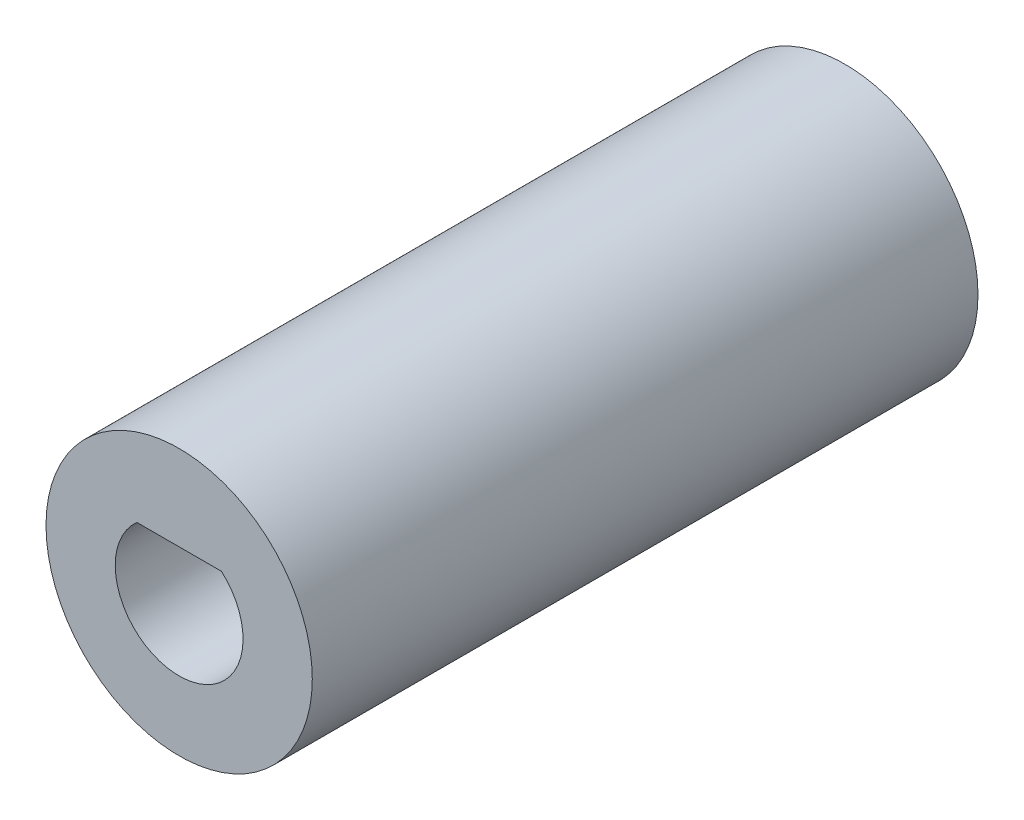
ISO-10303-21;
HEADER;
FILE_DESCRIPTION(('STEP AP214'),'2;1');
FILE_NAME('part.step','',(''),(''),'','','');
FILE_SCHEMA(('AUTOMOTIVE_DESIGN { 1 0 10303 214 1 1 1 1 }'));
ENDSEC;
DATA;
#1=APPLICATION_CONTEXT('core data for automotive mechanical design processes');
#2=APPLICATION_PROTOCOL_DEFINITION('international standard','automotive_design',2000,#1);
#3=PRODUCT_CONTEXT('',#1,'mechanical');
#4=PRODUCT('Part','Part','',(#3));
#5=PRODUCT_RELATED_PRODUCT_CATEGORY('part','',(#4));
#6=PRODUCT_DEFINITION_FORMATION('','',#4);
#7=PRODUCT_DEFINITION_CONTEXT('part definition',#1,'design');
#8=PRODUCT_DEFINITION('design','',#6,#7);
#9=PRODUCT_DEFINITION_SHAPE('','',#8);
#10=(LENGTH_UNIT() NAMED_UNIT(*) SI_UNIT(.MILLI.,.METRE.));
#11=(NAMED_UNIT(*) PLANE_ANGLE_UNIT() SI_UNIT($,.RADIAN.));
#12=(NAMED_UNIT(*) SI_UNIT($,.STERADIAN.) SOLID_ANGLE_UNIT());
#13=UNCERTAINTY_MEASURE_WITH_UNIT(LENGTH_MEASURE(1.E-05),#10,'distance_accuracy_value','');
#14=(GEOMETRIC_REPRESENTATION_CONTEXT(3) GLOBAL_UNCERTAINTY_ASSIGNED_CONTEXT((#13)) GLOBAL_UNIT_ASSIGNED_CONTEXT((#10,
#11,#12)) REPRESENTATION_CONTEXT('',''));
#15=CARTESIAN_POINT('',(0.,0.,0.));
#16=DIRECTION('',(0.,0.,1.));
#17=DIRECTION('',(1.,0.,0.));
#18=AXIS2_PLACEMENT_3D('',#15,#16,#17);
#19=CARTESIAN_POINT('',(0.,0.,31.75));
#20=DIRECTION('',(0.,0.,-1.));
#21=DIRECTION('',(-1.,0.,0.));
#22=AXIS2_PLACEMENT_3D('',#19,#20,#21);
#23=CYLINDRICAL_SURFACE('',#22,6.35);
#24=CARTESIAN_POINT('',(0.,0.,31.75));
#25=DIRECTION('',(0.,0.,1.));
#26=DIRECTION('',(1.,0.,0.));
#27=AXIS2_PLACEMENT_3D('',#24,#25,#26);
#28=CIRCLE('',#27,6.35);
#29=CARTESIAN_POINT('',(6.35,0.,31.75));
#30=VERTEX_POINT('',#29);
#31=EDGE_CURVE('E11',#30,#30,#28,.T.);
#32=ORIENTED_EDGE('',*,*,#31,.F.);
#33=EDGE_LOOP('',(#32));
#34=FACE_BOUND('',#33,.T.);
#35=CARTESIAN_POINT('',(0.,0.,0.));
#36=DIRECTION('',(0.,0.,1.));
#37=DIRECTION('',(1.,0.,0.));
#38=AXIS2_PLACEMENT_3D('',#35,#36,#37);
#39=CIRCLE('',#38,6.35);
#40=CARTESIAN_POINT('',(6.35,0.,0.));
#41=VERTEX_POINT('',#40);
#42=EDGE_CURVE('E38',#41,#41,#39,.T.);
#43=ORIENTED_EDGE('',*,*,#42,.T.);
#44=EDGE_LOOP('',(#43));
#45=FACE_BOUND('',#44,.T.);
#46=ADVANCED_FACE('F35',(#34,#45),#23,.T.);
#47=CARTESIAN_POINT('',(0.,0.,31.75));
#48=DIRECTION('',(0.,0.,1.));
#49=DIRECTION('',(1.,0.,0.));
#50=AXIS2_PLACEMENT_3D('',#47,#48,#49);
#51=PLANE('',#50);
#52=CARTESIAN_POINT('',(0.,0.,31.75));
#53=DIRECTION('',(0.,0.,1.));
#54=DIRECTION('',(1.,0.,0.));
#55=AXIS2_PLACEMENT_3D('',#52,#53,#54);
#56=CIRCLE('',#55,3.048);
#57=CARTESIAN_POINT('',(-2.01606249903122,2.286,31.75));
#58=VERTEX_POINT('',#57);
#59=CARTESIAN_POINT('',(2.01606249903122,2.286,31.75));
#60=VERTEX_POINT('',#59);
#61=EDGE_CURVE('E49',#58,#60,#56,.T.);
#62=ORIENTED_EDGE('',*,*,#61,.F.);
#63=DIRECTION('',(-1.,0.,0.));
#64=VECTOR('',#63,1.);
#65=CARTESIAN_POINT('',(2.01606249903122,2.286,31.75));
#66=LINE('',#65,#64);
#67=EDGE_CURVE('E71',#60,#58,#66,.T.);
#68=ORIENTED_EDGE('',*,*,#67,.F.);
#69=EDGE_LOOP('',(#62,#68));
#70=FACE_BOUND('',#69,.T.);
#71=ORIENTED_EDGE('',*,*,#31,.T.);
#72=EDGE_LOOP('',(#71));
#73=FACE_BOUND('',#72,.T.);
#74=ADVANCED_FACE('F83',(#70,#73),#51,.T.);
#75=CARTESIAN_POINT('',(0.,0.,0.));
#76=DIRECTION('',(0.,0.,1.));
#77=DIRECTION('',(1.,0.,0.));
#78=AXIS2_PLACEMENT_3D('',#75,#76,#77);
#79=PLANE('',#78);
#80=CARTESIAN_POINT('',(0.,0.,0.));
#81=DIRECTION('',(0.,0.,-1.));
#82=DIRECTION('',(-1.,0.,0.));
#83=AXIS2_PLACEMENT_3D('',#80,#81,#82);
#84=CIRCLE('',#83,3.175);
#85=CARTESIAN_POINT('',(-3.175,0.,0.));
#86=VERTEX_POINT('',#85);
#87=EDGE_CURVE('E77',#86,#86,#84,.T.);
#88=ORIENTED_EDGE('',*,*,#87,.F.);
#89=EDGE_LOOP('',(#88));
#90=FACE_BOUND('',#89,.T.);
#91=ORIENTED_EDGE('',*,*,#42,.F.);
#92=EDGE_LOOP('',(#91));
#93=FACE_BOUND('',#92,.T.);
#94=ADVANCED_FACE('F86',(#90,#93),#79,.F.);
#95=CARTESIAN_POINT('',(0.,0.,12.7));
#96=DIRECTION('',(0.,0.,1.));
#97=DIRECTION('',(1.,0.,0.));
#98=AXIS2_PLACEMENT_3D('',#95,#96,#97);
#99=CYLINDRICAL_SURFACE('',#98,3.048);
#100=ORIENTED_EDGE('',*,*,#61,.T.);
#101=DIRECTION('',(0.,0.,1.));
#102=VECTOR('',#101,1.);
#103=CARTESIAN_POINT('',(2.01606249903122,2.286,12.7));
#104=LINE('',#103,#102);
#105=CARTESIAN_POINT('',(2.01606249903122,2.286,12.7));
#106=VERTEX_POINT('',#105);
#107=EDGE_CURVE('E65',#106,#60,#104,.T.);
#108=ORIENTED_EDGE('',*,*,#107,.F.);
#109=CARTESIAN_POINT('',(0.,0.,12.7));
#110=DIRECTION('',(0.,0.,1.));
#111=DIRECTION('',(1.,0.,0.));
#112=AXIS2_PLACEMENT_3D('',#109,#110,#111);
#113=CIRCLE('',#112,3.048);
#114=CARTESIAN_POINT('',(-2.01606249903122,2.286,12.7));
#115=VERTEX_POINT('',#114);
#116=EDGE_CURVE('E57',#115,#106,#113,.T.);
#117=ORIENTED_EDGE('',*,*,#116,.F.);
#118=DIRECTION('',(0.,0.,1.));
#119=VECTOR('',#118,1.);
#120=CARTESIAN_POINT('',(-2.01606249903122,2.286,12.7));
#121=LINE('',#120,#119);
#122=EDGE_CURVE('E68',#115,#58,#121,.T.);
#123=ORIENTED_EDGE('',*,*,#122,.T.);
#124=EDGE_LOOP('',(#100,#108,#117,#123));
#125=FACE_BOUND('',#124,.T.);
#126=ADVANCED_FACE('F73',(#125),#99,.F.);
#127=CARTESIAN_POINT('',(2.01606249903122,2.286,12.7));
#128=DIRECTION('',(0.,1.,0.));
#129=DIRECTION('',(0.,0.,1.));
#130=AXIS2_PLACEMENT_3D('',#127,#128,#129);
#131=PLANE('',#130);
#132=ORIENTED_EDGE('',*,*,#67,.T.);
#133=ORIENTED_EDGE('',*,*,#122,.F.);
#134=DIRECTION('',(-1.,0.,0.));
#135=VECTOR('',#134,1.);
#136=CARTESIAN_POINT('',(2.01606249903122,2.286,12.7));
#137=LINE('',#136,#135);
#138=EDGE_CURVE('E61',#106,#115,#137,.T.);
#139=ORIENTED_EDGE('',*,*,#138,.F.);
#140=ORIENTED_EDGE('',*,*,#107,.T.);
#141=EDGE_LOOP('',(#132,#133,#139,#140));
#142=FACE_BOUND('',#141,.T.);
#143=ADVANCED_FACE('F69',(#142),#131,.F.);
#144=CARTESIAN_POINT('',(0.,0.,12.7));
#145=DIRECTION('',(0.,0.,-1.));
#146=DIRECTION('',(-1.,0.,0.));
#147=AXIS2_PLACEMENT_3D('',#144,#145,#146);
#148=PLANE('',#147);
#149=CARTESIAN_POINT('',(0.,0.,12.7));
#150=DIRECTION('',(0.,0.,-1.));
#151=DIRECTION('',(-1.,0.,0.));
#152=AXIS2_PLACEMENT_3D('',#149,#150,#151);
#153=CIRCLE('',#152,3.175);
#154=CARTESIAN_POINT('',(-3.175,0.,12.7));
#155=VERTEX_POINT('',#154);
#156=EDGE_CURVE('E80',#155,#155,#153,.T.);
#157=ORIENTED_EDGE('',*,*,#156,.T.);
#158=EDGE_LOOP('',(#157));
#159=FACE_BOUND('',#158,.T.);
#160=ORIENTED_EDGE('',*,*,#116,.T.);
#161=ORIENTED_EDGE('',*,*,#138,.T.);
#162=EDGE_LOOP('',(#160,#161));
#163=FACE_BOUND('',#162,.T.);
#164=ADVANCED_FACE('F63',(#159,#163),#148,.T.);
#165=CARTESIAN_POINT('',(0.,0.,12.7));
#166=DIRECTION('',(0.,0.,-1.));
#167=DIRECTION('',(-1.,0.,0.));
#168=AXIS2_PLACEMENT_3D('',#165,#166,#167);
#169=CYLINDRICAL_SURFACE('',#168,3.175);
#170=ORIENTED_EDGE('',*,*,#156,.F.);
#171=EDGE_LOOP('',(#170));
#172=FACE_BOUND('',#171,.T.);
#173=ORIENTED_EDGE('',*,*,#87,.T.);
#174=EDGE_LOOP('',(#173));
#175=FACE_BOUND('',#174,.T.);
#176=ADVANCED_FACE('F105',(#172,#175),#169,.F.);
#177=CLOSED_SHELL('',(#46,#74,#94,#126,#143,#164,#176));
#178=MANIFOLD_SOLID_BREP('B2',#177);
#179=ADVANCED_BREP_SHAPE_REPRESENTATION('',(#18,#178),#14);
#180=SHAPE_DEFINITION_REPRESENTATION(#9,#179);
ENDSEC;
END-ISO-10303-21;
